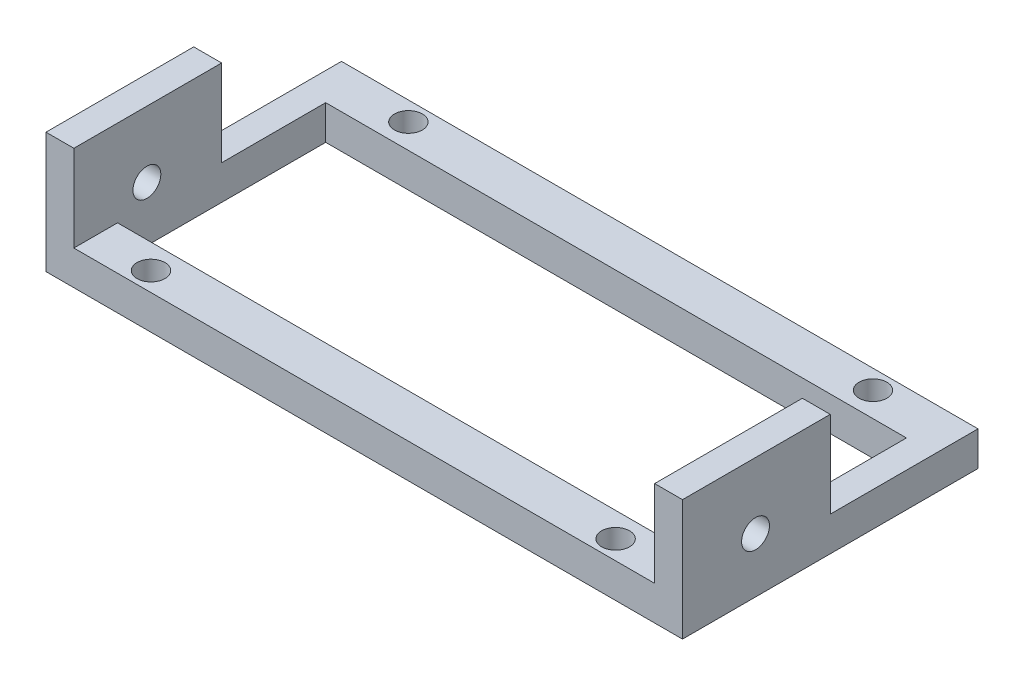
ISO-10303-21;
HEADER;
FILE_DESCRIPTION(('STEP AP214'),'2;1');
FILE_NAME('part.step','',(''),(''),'','','');
FILE_SCHEMA(('AUTOMOTIVE_DESIGN { 1 0 10303 214 1 1 1 1 }'));
ENDSEC;
DATA;
#1=APPLICATION_CONTEXT('core data for automotive mechanical design processes');
#2=APPLICATION_PROTOCOL_DEFINITION('international standard','automotive_design',2000,#1);
#3=PRODUCT_CONTEXT('',#1,'mechanical');
#4=PRODUCT('Part','Part','',(#3));
#5=PRODUCT_RELATED_PRODUCT_CATEGORY('part','',(#4));
#6=PRODUCT_DEFINITION_FORMATION('','',#4);
#7=PRODUCT_DEFINITION_CONTEXT('part definition',#1,'design');
#8=PRODUCT_DEFINITION('design','',#6,#7);
#9=PRODUCT_DEFINITION_SHAPE('','',#8);
#10=(LENGTH_UNIT() NAMED_UNIT(*) SI_UNIT(.MILLI.,.METRE.));
#11=(NAMED_UNIT(*) PLANE_ANGLE_UNIT() SI_UNIT($,.RADIAN.));
#12=(NAMED_UNIT(*) SI_UNIT($,.STERADIAN.) SOLID_ANGLE_UNIT());
#13=UNCERTAINTY_MEASURE_WITH_UNIT(LENGTH_MEASURE(1.E-05),#10,'distance_accuracy_value','');
#14=(GEOMETRIC_REPRESENTATION_CONTEXT(3) GLOBAL_UNCERTAINTY_ASSIGNED_CONTEXT((#13)) GLOBAL_UNIT_ASSIGNED_CONTEXT((#10,
#11,#12)) REPRESENTATION_CONTEXT('',''));
#15=CARTESIAN_POINT('',(0.,0.,0.));
#16=DIRECTION('',(0.,0.,1.));
#17=DIRECTION('',(1.,0.,0.));
#18=AXIS2_PLACEMENT_3D('',#15,#16,#17);
#19=CARTESIAN_POINT('',(0.,3.7,0.));
#20=DIRECTION('',(0.,1.,0.));
#21=DIRECTION('',(0.,0.,1.));
#22=AXIS2_PLACEMENT_3D('',#19,#20,#21);
#23=PLANE('',#22);
#24=CARTESIAN_POINT('',(-25.,3.7,-0.3));
#25=DIRECTION('',(0.,1.,0.));
#26=DIRECTION('',(0.,0.,1.));
#27=AXIS2_PLACEMENT_3D('',#24,#25,#26);
#28=CIRCLE('',#27,1.5);
#29=CARTESIAN_POINT('',(-25.,3.7,1.2));
#30=VERTEX_POINT('',#29);
#31=EDGE_CURVE('E271',#30,#30,#28,.T.);
#32=ORIENTED_EDGE('',*,*,#31,.F.);
#33=EDGE_LOOP('',(#32));
#34=FACE_BOUND('',#33,.T.);
#35=CARTESIAN_POINT('',(25.,3.7,-0.3));
#36=DIRECTION('',(0.,1.,0.));
#37=DIRECTION('',(0.,0.,1.));
#38=AXIS2_PLACEMENT_3D('',#35,#36,#37);
#39=CIRCLE('',#38,1.5);
#40=CARTESIAN_POINT('',(25.,3.7,1.2));
#41=VERTEX_POINT('',#40);
#42=EDGE_CURVE('E265',#41,#41,#39,.T.);
#43=ORIENTED_EDGE('',*,*,#42,.F.);
#44=EDGE_LOOP('',(#43));
#45=FACE_BOUND('',#44,.T.);
#46=DIRECTION('',(0.,0.,-1.));
#47=VECTOR('',#46,1.);
#48=CARTESIAN_POINT('',(31.25,3.7,-2.35));
#49=LINE('',#48,#47);
#50=CARTESIAN_POINT('',(31.25,3.7,13.55));
#51=VERTEX_POINT('',#50);
#52=CARTESIAN_POINT('',(31.25,3.7,2.35));
#53=VERTEX_POINT('',#52);
#54=EDGE_CURVE('E61',#51,#53,#49,.T.);
#55=ORIENTED_EDGE('',*,*,#54,.F.);
#56=DIRECTION('',(1.,0.,0.));
#57=VECTOR('',#56,1.);
#58=CARTESIAN_POINT('',(0.,3.7,13.55));
#59=LINE('',#58,#57);
#60=CARTESIAN_POINT('',(34.25,3.7,13.55));
#61=VERTEX_POINT('',#60);
#62=EDGE_CURVE('E185',#51,#61,#59,.T.);
#63=ORIENTED_EDGE('',*,*,#62,.T.);
#64=DIRECTION('',(0.,0.,-1.));
#65=VECTOR('',#64,1.);
#66=CARTESIAN_POINT('',(34.25,3.7,-2.35));
#67=LINE('',#66,#65);
#68=CARTESIAN_POINT('',(34.25,3.7,-2.35));
#69=VERTEX_POINT('',#68);
#70=EDGE_CURVE('E152',#61,#69,#67,.T.);
#71=ORIENTED_EDGE('',*,*,#70,.T.);
#72=DIRECTION('',(-1.,0.,0.));
#73=VECTOR('',#72,1.);
#74=CARTESIAN_POINT('',(-31.25,3.7,-2.35));
#75=LINE('',#74,#73);
#76=CARTESIAN_POINT('',(-34.25,3.7,-2.35));
#77=VERTEX_POINT('',#76);
#78=EDGE_CURVE('E277',#69,#77,#75,.T.);
#79=ORIENTED_EDGE('',*,*,#78,.T.);
#80=DIRECTION('',(0.,0.,-1.));
#81=VECTOR('',#80,1.);
#82=CARTESIAN_POINT('',(-34.25,3.7,-2.35));
#83=LINE('',#82,#81);
#84=CARTESIAN_POINT('',(-34.25,3.7,13.55));
#85=VERTEX_POINT('',#84);
#86=EDGE_CURVE('E258',#85,#77,#83,.T.);
#87=ORIENTED_EDGE('',*,*,#86,.F.);
#88=DIRECTION('',(-1.,0.,0.));
#89=VECTOR('',#88,1.);
#90=CARTESIAN_POINT('',(0.,3.7,13.55));
#91=LINE('',#90,#89);
#92=CARTESIAN_POINT('',(-31.25,3.7,13.55));
#93=VERTEX_POINT('',#92);
#94=EDGE_CURVE('E214',#93,#85,#91,.T.);
#95=ORIENTED_EDGE('',*,*,#94,.F.);
#96=DIRECTION('',(0.,0.,-1.));
#97=VECTOR('',#96,1.);
#98=CARTESIAN_POINT('',(-31.25,3.7,-2.35));
#99=LINE('',#98,#97);
#100=CARTESIAN_POINT('',(-31.25,3.7,2.35));
#101=VERTEX_POINT('',#100);
#102=EDGE_CURVE('E254',#93,#101,#99,.T.);
#103=ORIENTED_EDGE('',*,*,#102,.T.);
#104=DIRECTION('',(1.,0.,0.));
#105=VECTOR('',#104,1.);
#106=CARTESIAN_POINT('',(-31.25,3.7,2.35));
#107=LINE('',#106,#105);
#108=EDGE_CURVE('E280',#101,#53,#107,.T.);
#109=ORIENTED_EDGE('',*,*,#108,.T.);
#110=EDGE_LOOP('',(#55,#63,#71,#79,#87,#95,#103,#109));
#111=FACE_BOUND('',#110,.T.);
#112=ADVANCED_FACE('F37',(#34,#45,#111),#23,.T.);
#113=CARTESIAN_POINT('',(-25.,3.7,27.4));
#114=DIRECTION('',(0.,-1.,0.));
#115=DIRECTION('',(0.,0.,-1.));
#116=AXIS2_PLACEMENT_3D('',#113,#114,#115);
#117=CIRCLE('',#116,1.5);
#118=CARTESIAN_POINT('',(-25.,3.7,25.9));
#119=VERTEX_POINT('',#118);
#120=EDGE_CURVE('E224',#119,#119,#117,.T.);
#121=ORIENTED_EDGE('',*,*,#120,.T.);
#122=EDGE_LOOP('',(#121));
#123=FACE_BOUND('',#122,.T.);
#124=CARTESIAN_POINT('',(25.,3.7,27.4));
#125=DIRECTION('',(0.,-1.,0.));
#126=DIRECTION('',(0.,0.,-1.));
#127=AXIS2_PLACEMENT_3D('',#124,#125,#126);
#128=CIRCLE('',#127,1.5);
#129=CARTESIAN_POINT('',(25.,3.7,25.9));
#130=VERTEX_POINT('',#129);
#131=EDGE_CURVE('E218',#130,#130,#128,.T.);
#132=ORIENTED_EDGE('',*,*,#131,.T.);
#133=EDGE_LOOP('',(#132));
#134=FACE_BOUND('',#133,.T.);
#135=DIRECTION('',(1.,0.,0.));
#136=VECTOR('',#135,1.);
#137=CARTESIAN_POINT('',(-34.25,3.7,29.45));
#138=LINE('',#137,#136);
#139=CARTESIAN_POINT('',(-31.25,3.7,29.45));
#140=VERTEX_POINT('',#139);
#141=CARTESIAN_POINT('',(31.25,3.7,29.45));
#142=VERTEX_POINT('',#141);
#143=EDGE_CURVE('E53',#140,#142,#138,.T.);
#144=ORIENTED_EDGE('',*,*,#143,.T.);
#145=DIRECTION('',(0.,0.,-1.));
#146=VECTOR('',#145,1.);
#147=CARTESIAN_POINT('',(31.25,3.7,0.));
#148=LINE('',#147,#146);
#149=CARTESIAN_POINT('',(31.25,3.7,24.75));
#150=VERTEX_POINT('',#149);
#151=EDGE_CURVE('E179',#142,#150,#148,.T.);
#152=ORIENTED_EDGE('',*,*,#151,.T.);
#153=DIRECTION('',(1.,0.,0.));
#154=VECTOR('',#153,1.);
#155=CARTESIAN_POINT('',(-31.25,3.7,24.75));
#156=LINE('',#155,#154);
#157=CARTESIAN_POINT('',(-31.25,3.7,24.75));
#158=VERTEX_POINT('',#157);
#159=EDGE_CURVE('E230',#158,#150,#156,.T.);
#160=ORIENTED_EDGE('',*,*,#159,.F.);
#161=DIRECTION('',(0.,0.,-1.));
#162=VECTOR('',#161,1.);
#163=CARTESIAN_POINT('',(-31.25,3.7,0.));
#164=LINE('',#163,#162);
#165=EDGE_CURVE('E206',#140,#158,#164,.T.);
#166=ORIENTED_EDGE('',*,*,#165,.F.);
#167=EDGE_LOOP('',(#144,#152,#160,#166));
#168=FACE_BOUND('',#167,.T.);
#169=ADVANCED_FACE('F305',(#123,#134,#168),#23,.T.);
#170=CARTESIAN_POINT('',(0.,0.,0.));
#171=DIRECTION('',(0.,1.,0.));
#172=DIRECTION('',(0.,0.,1.));
#173=AXIS2_PLACEMENT_3D('',#170,#171,#172);
#174=PLANE('',#173);
#175=DIRECTION('',(0.,0.,1.));
#176=VECTOR('',#175,1.);
#177=CARTESIAN_POINT('',(34.25,0.,-2.35));
#178=LINE('',#177,#176);
#179=CARTESIAN_POINT('',(34.25,0.,-2.35));
#180=VERTEX_POINT('',#179);
#181=CARTESIAN_POINT('',(34.25,0.,29.45));
#182=VERTEX_POINT('',#181);
#183=EDGE_CURVE('E151',#180,#182,#178,.T.);
#184=ORIENTED_EDGE('',*,*,#183,.T.);
#185=DIRECTION('',(1.,0.,0.));
#186=VECTOR('',#185,1.);
#187=CARTESIAN_POINT('',(-34.25,0.,29.45));
#188=LINE('',#187,#186);
#189=CARTESIAN_POINT('',(-34.25,0.,29.45));
#190=VERTEX_POINT('',#189);
#191=EDGE_CURVE('E146',#190,#182,#188,.T.);
#192=ORIENTED_EDGE('',*,*,#191,.F.);
#193=DIRECTION('',(0.,0.,1.));
#194=VECTOR('',#193,1.);
#195=CARTESIAN_POINT('',(-34.25,0.,-2.35));
#196=LINE('',#195,#194);
#197=CARTESIAN_POINT('',(-34.25,0.,-2.35));
#198=VERTEX_POINT('',#197);
#199=EDGE_CURVE('E253',#198,#190,#196,.T.);
#200=ORIENTED_EDGE('',*,*,#199,.F.);
#201=DIRECTION('',(-1.,0.,0.));
#202=VECTOR('',#201,1.);
#203=CARTESIAN_POINT('',(-31.25,0.,-2.35));
#204=LINE('',#203,#202);
#205=EDGE_CURVE('E274',#180,#198,#204,.T.);
#206=ORIENTED_EDGE('',*,*,#205,.F.);
#207=EDGE_LOOP('',(#184,#192,#200,#206));
#208=FACE_BOUND('',#207,.T.);
#209=DIRECTION('',(1.,0.,0.));
#210=VECTOR('',#209,1.);
#211=CARTESIAN_POINT('',(-31.25,0.,24.75));
#212=LINE('',#211,#210);
#213=CARTESIAN_POINT('',(-31.25,0.,24.75));
#214=VERTEX_POINT('',#213);
#215=CARTESIAN_POINT('',(31.25,0.,24.75));
#216=VERTEX_POINT('',#215);
#217=EDGE_CURVE('E227',#214,#216,#212,.T.);
#218=ORIENTED_EDGE('',*,*,#217,.T.);
#219=DIRECTION('',(0.,0.,1.));
#220=VECTOR('',#219,1.);
#221=CARTESIAN_POINT('',(31.25,0.,-2.35));
#222=LINE('',#221,#220);
#223=CARTESIAN_POINT('',(31.25,0.,2.35));
#224=VERTEX_POINT('',#223);
#225=EDGE_CURVE('E244',#224,#216,#222,.T.);
#226=ORIENTED_EDGE('',*,*,#225,.F.);
#227=DIRECTION('',(1.,0.,0.));
#228=VECTOR('',#227,1.);
#229=CARTESIAN_POINT('',(-31.25,0.,2.35));
#230=LINE('',#229,#228);
#231=CARTESIAN_POINT('',(-31.25,0.,2.35));
#232=VERTEX_POINT('',#231);
#233=EDGE_CURVE('E281',#232,#224,#230,.T.);
#234=ORIENTED_EDGE('',*,*,#233,.F.);
#235=DIRECTION('',(0.,0.,1.));
#236=VECTOR('',#235,1.);
#237=CARTESIAN_POINT('',(-31.25,0.,-2.35));
#238=LINE('',#237,#236);
#239=EDGE_CURVE('E247',#232,#214,#238,.T.);
#240=ORIENTED_EDGE('',*,*,#239,.T.);
#241=EDGE_LOOP('',(#218,#226,#234,#240));
#242=FACE_BOUND('',#241,.T.);
#243=CARTESIAN_POINT('',(-25.,0.,27.4));
#244=DIRECTION('',(0.,-1.,0.));
#245=DIRECTION('',(0.,0.,-1.));
#246=AXIS2_PLACEMENT_3D('',#243,#244,#245);
#247=CIRCLE('',#246,1.5);
#248=CARTESIAN_POINT('',(-25.,0.,25.9));
#249=VERTEX_POINT('',#248);
#250=EDGE_CURVE('E221',#249,#249,#247,.T.);
#251=ORIENTED_EDGE('',*,*,#250,.F.);
#252=EDGE_LOOP('',(#251));
#253=FACE_BOUND('',#252,.T.);
#254=CARTESIAN_POINT('',(25.,0.,27.4));
#255=DIRECTION('',(0.,-1.,0.));
#256=DIRECTION('',(0.,0.,-1.));
#257=AXIS2_PLACEMENT_3D('',#254,#255,#256);
#258=CIRCLE('',#257,1.5);
#259=CARTESIAN_POINT('',(25.,0.,25.9));
#260=VERTEX_POINT('',#259);
#261=EDGE_CURVE('E217',#260,#260,#258,.T.);
#262=ORIENTED_EDGE('',*,*,#261,.F.);
#263=EDGE_LOOP('',(#262));
#264=FACE_BOUND('',#263,.T.);
#265=CARTESIAN_POINT('',(25.,0.,-0.3));
#266=DIRECTION('',(0.,1.,0.));
#267=DIRECTION('',(0.,0.,1.));
#268=AXIS2_PLACEMENT_3D('',#265,#266,#267);
#269=CIRCLE('',#268,1.5);
#270=CARTESIAN_POINT('',(25.,0.,1.2));
#271=VERTEX_POINT('',#270);
#272=EDGE_CURVE('E264',#271,#271,#269,.T.);
#273=ORIENTED_EDGE('',*,*,#272,.T.);
#274=EDGE_LOOP('',(#273));
#275=FACE_BOUND('',#274,.T.);
#276=CARTESIAN_POINT('',(-25.,0.,-0.3));
#277=DIRECTION('',(0.,1.,0.));
#278=DIRECTION('',(0.,0.,1.));
#279=AXIS2_PLACEMENT_3D('',#276,#277,#278);
#280=CIRCLE('',#279,1.5);
#281=CARTESIAN_POINT('',(-25.,0.,1.2));
#282=VERTEX_POINT('',#281);
#283=EDGE_CURVE('E268',#282,#282,#280,.T.);
#284=ORIENTED_EDGE('',*,*,#283,.T.);
#285=EDGE_LOOP('',(#284));
#286=FACE_BOUND('',#285,.T.);
#287=ADVANCED_FACE('F295',(#208,#242,#253,#264,#275,#286),#174,.F.);
#288=CARTESIAN_POINT('',(-31.25,3.7,-2.35));
#289=DIRECTION('',(0.,0.,1.));
#290=DIRECTION('',(1.,0.,0.));
#291=AXIS2_PLACEMENT_3D('',#288,#289,#290);
#292=PLANE('',#291);
#293=ORIENTED_EDGE('',*,*,#205,.T.);
#294=DIRECTION('',(0.,-1.,0.));
#295=VECTOR('',#294,1.);
#296=CARTESIAN_POINT('',(-34.25,3.7,-2.35));
#297=LINE('',#296,#295);
#298=EDGE_CURVE('E250',#77,#198,#297,.T.);
#299=ORIENTED_EDGE('',*,*,#298,.F.);
#300=ORIENTED_EDGE('',*,*,#78,.F.);
#301=DIRECTION('',(0.,-1.,0.));
#302=VECTOR('',#301,1.);
#303=CARTESIAN_POINT('',(34.25,3.7,-2.35));
#304=LINE('',#303,#302);
#305=EDGE_CURVE('E241',#69,#180,#304,.T.);
#306=ORIENTED_EDGE('',*,*,#305,.T.);
#307=EDGE_LOOP('',(#293,#299,#300,#306));
#308=FACE_BOUND('',#307,.T.);
#309=ADVANCED_FACE('F39',(#308),#292,.F.);
#310=CARTESIAN_POINT('',(-31.25,3.7,2.35));
#311=DIRECTION('',(0.,0.,-1.));
#312=DIRECTION('',(-1.,0.,0.));
#313=AXIS2_PLACEMENT_3D('',#310,#311,#312);
#314=PLANE('',#313);
#315=ORIENTED_EDGE('',*,*,#233,.T.);
#316=DIRECTION('',(0.,-1.,0.));
#317=VECTOR('',#316,1.);
#318=CARTESIAN_POINT('',(31.25,3.7,2.35));
#319=LINE('',#318,#317);
#320=EDGE_CURVE('E46',#53,#224,#319,.T.);
#321=ORIENTED_EDGE('',*,*,#320,.F.);
#322=ORIENTED_EDGE('',*,*,#108,.F.);
#323=DIRECTION('',(0.,-1.,0.));
#324=VECTOR('',#323,1.);
#325=CARTESIAN_POINT('',(-31.25,3.7,2.35));
#326=LINE('',#325,#324);
#327=EDGE_CURVE('E11',#101,#232,#326,.T.);
#328=ORIENTED_EDGE('',*,*,#327,.T.);
#329=EDGE_LOOP('',(#315,#321,#322,#328));
#330=FACE_BOUND('',#329,.T.);
#331=ADVANCED_FACE('F324',(#330),#314,.F.);
#332=CARTESIAN_POINT('',(-25.,3.7,-0.3));
#333=DIRECTION('',(0.,-1.,0.));
#334=DIRECTION('',(0.,0.,-1.));
#335=AXIS2_PLACEMENT_3D('',#332,#333,#334);
#336=CYLINDRICAL_SURFACE('',#335,1.5);
#337=ORIENTED_EDGE('',*,*,#31,.T.);
#338=EDGE_LOOP('',(#337));
#339=FACE_BOUND('',#338,.T.);
#340=ORIENTED_EDGE('',*,*,#283,.F.);
#341=EDGE_LOOP('',(#340));
#342=FACE_BOUND('',#341,.T.);
#343=ADVANCED_FACE('F326',(#339,#342),#336,.F.);
#344=CARTESIAN_POINT('',(25.,3.7,-0.3));
#345=DIRECTION('',(0.,-1.,0.));
#346=DIRECTION('',(0.,0.,-1.));
#347=AXIS2_PLACEMENT_3D('',#344,#345,#346);
#348=CYLINDRICAL_SURFACE('',#347,1.5);
#349=ORIENTED_EDGE('',*,*,#42,.T.);
#350=EDGE_LOOP('',(#349));
#351=FACE_BOUND('',#350,.T.);
#352=ORIENTED_EDGE('',*,*,#272,.F.);
#353=EDGE_LOOP('',(#352));
#354=FACE_BOUND('',#353,.T.);
#355=ADVANCED_FACE('F331',(#351,#354),#348,.F.);
#356=CARTESIAN_POINT('',(-34.25,3.7,29.45));
#357=DIRECTION('',(0.,0.,-1.));
#358=DIRECTION('',(0.,1.,0.));
#359=AXIS2_PLACEMENT_3D('',#356,#357,#358);
#360=PLANE('',#359);
#361=DIRECTION('',(0.,1.,0.));
#362=VECTOR('',#361,1.);
#363=CARTESIAN_POINT('',(34.25,3.7,29.45));
#364=LINE('',#363,#362);
#365=CARTESIAN_POINT('',(34.25,13.,29.45));
#366=VERTEX_POINT('',#365);
#367=EDGE_CURVE('E139',#182,#366,#364,.T.);
#368=ORIENTED_EDGE('',*,*,#367,.T.);
#369=DIRECTION('',(1.,0.,0.));
#370=VECTOR('',#369,1.);
#371=CARTESIAN_POINT('',(34.25,13.,29.45));
#372=LINE('',#371,#370);
#373=CARTESIAN_POINT('',(31.25,13.,29.45));
#374=VERTEX_POINT('',#373);
#375=EDGE_CURVE('E143',#374,#366,#372,.T.);
#376=ORIENTED_EDGE('',*,*,#375,.F.);
#377=DIRECTION('',(0.,-1.,0.));
#378=VECTOR('',#377,1.);
#379=CARTESIAN_POINT('',(31.25,13.,29.45));
#380=LINE('',#379,#378);
#381=EDGE_CURVE('E177',#374,#142,#380,.T.);
#382=ORIENTED_EDGE('',*,*,#381,.T.);
#383=ORIENTED_EDGE('',*,*,#143,.F.);
#384=DIRECTION('',(0.,-1.,0.));
#385=VECTOR('',#384,1.);
#386=CARTESIAN_POINT('',(-31.25,13.,29.45));
#387=LINE('',#386,#385);
#388=CARTESIAN_POINT('',(-31.25,13.,29.45));
#389=VERTEX_POINT('',#388);
#390=EDGE_CURVE('E203',#389,#140,#387,.T.);
#391=ORIENTED_EDGE('',*,*,#390,.F.);
#392=DIRECTION('',(-1.,0.,0.));
#393=VECTOR('',#392,1.);
#394=CARTESIAN_POINT('',(-34.25,13.,29.45));
#395=LINE('',#394,#393);
#396=CARTESIAN_POINT('',(-34.25,13.,29.45));
#397=VERTEX_POINT('',#396);
#398=EDGE_CURVE('E199',#389,#397,#395,.T.);
#399=ORIENTED_EDGE('',*,*,#398,.T.);
#400=DIRECTION('',(0.,1.,0.));
#401=VECTOR('',#400,1.);
#402=CARTESIAN_POINT('',(-34.25,3.7,29.45));
#403=LINE('',#402,#401);
#404=EDGE_CURVE('E256',#190,#397,#403,.T.);
#405=ORIENTED_EDGE('',*,*,#404,.F.);
#406=ORIENTED_EDGE('',*,*,#191,.T.);
#407=EDGE_LOOP('',(#368,#376,#382,#383,#391,#399,#405,#406));
#408=FACE_BOUND('',#407,.T.);
#409=ADVANCED_FACE('F141',(#408),#360,.F.);
#410=CARTESIAN_POINT('',(-34.25,0.,0.));
#411=DIRECTION('',(-1.,0.,0.));
#412=DIRECTION('',(0.,0.,1.));
#413=AXIS2_PLACEMENT_3D('',#410,#411,#412);
#414=PLANE('',#413);
#415=CARTESIAN_POINT('',(-34.25,5.9,21.5927431767042));
#416=DIRECTION('',(-1.,0.,0.));
#417=DIRECTION('',(0.,0.,1.));
#418=AXIS2_PLACEMENT_3D('',#415,#416,#417);
#419=CIRCLE('',#418,1.5);
#420=CARTESIAN_POINT('',(-34.25,5.9,23.0927431767042));
#421=VERTEX_POINT('',#420);
#422=EDGE_CURVE('E187',#421,#421,#419,.T.);
#423=ORIENTED_EDGE('',*,*,#422,.F.);
#424=EDGE_LOOP('',(#423));
#425=FACE_BOUND('',#424,.T.);
#426=ORIENTED_EDGE('',*,*,#199,.T.);
#427=ORIENTED_EDGE('',*,*,#404,.T.);
#428=DIRECTION('',(0.,0.,-1.));
#429=VECTOR('',#428,1.);
#430=CARTESIAN_POINT('',(-34.25,13.,29.45));
#431=LINE('',#430,#429);
#432=CARTESIAN_POINT('',(-34.25,13.,13.55));
#433=VERTEX_POINT('',#432);
#434=EDGE_CURVE('E190',#397,#433,#431,.T.);
#435=ORIENTED_EDGE('',*,*,#434,.T.);
#436=DIRECTION('',(0.,-1.,0.));
#437=VECTOR('',#436,1.);
#438=CARTESIAN_POINT('',(-34.25,13.,13.55));
#439=LINE('',#438,#437);
#440=EDGE_CURVE('E202',#433,#85,#439,.T.);
#441=ORIENTED_EDGE('',*,*,#440,.T.);
#442=ORIENTED_EDGE('',*,*,#86,.T.);
#443=ORIENTED_EDGE('',*,*,#298,.T.);
#444=EDGE_LOOP('',(#426,#427,#435,#441,#442,#443));
#445=FACE_BOUND('',#444,.T.);
#446=ADVANCED_FACE('F318',(#425,#445),#414,.T.);
#447=CARTESIAN_POINT('',(-31.25,0.,0.));
#448=DIRECTION('',(-1.,0.,0.));
#449=DIRECTION('',(0.,0.,1.));
#450=AXIS2_PLACEMENT_3D('',#447,#448,#449);
#451=PLANE('',#450);
#452=CARTESIAN_POINT('',(-31.25,5.9,21.5927431767042));
#453=DIRECTION('',(-1.,0.,0.));
#454=DIRECTION('',(0.,0.,1.));
#455=AXIS2_PLACEMENT_3D('',#452,#453,#454);
#456=CIRCLE('',#455,1.5);
#457=CARTESIAN_POINT('',(-31.25,5.9,23.0927431767042));
#458=VERTEX_POINT('',#457);
#459=EDGE_CURVE('E41',#458,#458,#456,.T.);
#460=ORIENTED_EDGE('',*,*,#459,.T.);
#461=EDGE_LOOP('',(#460));
#462=FACE_BOUND('',#461,.T.);
#463=ORIENTED_EDGE('',*,*,#102,.F.);
#464=DIRECTION('',(0.,-1.,0.));
#465=VECTOR('',#464,1.);
#466=CARTESIAN_POINT('',(-31.25,13.,13.55));
#467=LINE('',#466,#465);
#468=CARTESIAN_POINT('',(-31.25,13.,13.55));
#469=VERTEX_POINT('',#468);
#470=EDGE_CURVE('E207',#469,#93,#467,.T.);
#471=ORIENTED_EDGE('',*,*,#470,.F.);
#472=DIRECTION('',(0.,0.,1.));
#473=VECTOR('',#472,1.);
#474=CARTESIAN_POINT('',(-31.25,13.,29.45));
#475=LINE('',#474,#473);
#476=EDGE_CURVE('E196',#469,#389,#475,.T.);
#477=ORIENTED_EDGE('',*,*,#476,.T.);
#478=ORIENTED_EDGE('',*,*,#390,.T.);
#479=ORIENTED_EDGE('',*,*,#165,.T.);
#480=DIRECTION('',(0.,-1.,0.));
#481=VECTOR('',#480,1.);
#482=CARTESIAN_POINT('',(-31.25,3.7,24.75));
#483=LINE('',#482,#481);
#484=EDGE_CURVE('E233',#158,#214,#483,.T.);
#485=ORIENTED_EDGE('',*,*,#484,.T.);
#486=ORIENTED_EDGE('',*,*,#239,.F.);
#487=ORIENTED_EDGE('',*,*,#327,.F.);
#488=EDGE_LOOP('',(#463,#471,#477,#478,#479,#485,#486,#487));
#489=FACE_BOUND('',#488,.T.);
#490=ADVANCED_FACE('F303',(#462,#489),#451,.F.);
#491=CARTESIAN_POINT('',(31.25,0.,0.));
#492=DIRECTION('',(1.,0.,0.));
#493=DIRECTION('',(0.,0.,1.));
#494=AXIS2_PLACEMENT_3D('',#491,#492,#493);
#495=PLANE('',#494);
#496=CARTESIAN_POINT('',(31.25,5.9,21.5927431767042));
#497=DIRECTION('',(1.,0.,0.));
#498=DIRECTION('',(0.,0.,-1.));
#499=AXIS2_PLACEMENT_3D('',#496,#497,#498);
#500=CIRCLE('',#499,1.5);
#501=CARTESIAN_POINT('',(31.25,5.9,20.0927431767042));
#502=VERTEX_POINT('',#501);
#503=EDGE_CURVE('E167',#502,#502,#500,.F.);
#504=ORIENTED_EDGE('',*,*,#503,.F.);
#505=EDGE_LOOP('',(#504));
#506=FACE_BOUND('',#505,.T.);
#507=DIRECTION('',(0.,-1.,0.));
#508=VECTOR('',#507,1.);
#509=CARTESIAN_POINT('',(31.25,3.7,24.75));
#510=LINE('',#509,#508);
#511=EDGE_CURVE('E238',#150,#216,#510,.T.);
#512=ORIENTED_EDGE('',*,*,#511,.F.);
#513=ORIENTED_EDGE('',*,*,#151,.F.);
#514=ORIENTED_EDGE('',*,*,#381,.F.);
#515=DIRECTION('',(0.,0.,1.));
#516=VECTOR('',#515,1.);
#517=CARTESIAN_POINT('',(31.25,13.,29.45));
#518=LINE('',#517,#516);
#519=CARTESIAN_POINT('',(31.25,13.,13.55));
#520=VERTEX_POINT('',#519);
#521=EDGE_CURVE('E160',#520,#374,#518,.T.);
#522=ORIENTED_EDGE('',*,*,#521,.F.);
#523=DIRECTION('',(0.,-1.,0.));
#524=VECTOR('',#523,1.);
#525=CARTESIAN_POINT('',(31.25,13.,13.55));
#526=LINE('',#525,#524);
#527=EDGE_CURVE('E180',#520,#51,#526,.T.);
#528=ORIENTED_EDGE('',*,*,#527,.T.);
#529=ORIENTED_EDGE('',*,*,#54,.T.);
#530=ORIENTED_EDGE('',*,*,#320,.T.);
#531=ORIENTED_EDGE('',*,*,#225,.T.);
#532=EDGE_LOOP('',(#512,#513,#514,#522,#528,#529,#530,#531));
#533=FACE_BOUND('',#532,.T.);
#534=ADVANCED_FACE('F290',(#506,#533),#495,.F.);
#535=CARTESIAN_POINT('',(34.25,0.,0.));
#536=DIRECTION('',(1.,0.,0.));
#537=DIRECTION('',(0.,0.,1.));
#538=AXIS2_PLACEMENT_3D('',#535,#536,#537);
#539=PLANE('',#538);
#540=CARTESIAN_POINT('',(34.25,5.9,21.5927431767042));
#541=DIRECTION('',(-1.,0.,0.));
#542=DIRECTION('',(0.,0.,1.));
#543=AXIS2_PLACEMENT_3D('',#540,#541,#542);
#544=CIRCLE('',#543,1.5);
#545=CARTESIAN_POINT('',(34.25,5.9,23.0927431767042));
#546=VERTEX_POINT('',#545);
#547=EDGE_CURVE('E170',#546,#546,#544,.T.);
#548=ORIENTED_EDGE('',*,*,#547,.T.);
#549=EDGE_LOOP('',(#548));
#550=FACE_BOUND('',#549,.T.);
#551=ORIENTED_EDGE('',*,*,#367,.F.);
#552=ORIENTED_EDGE('',*,*,#183,.F.);
#553=ORIENTED_EDGE('',*,*,#305,.F.);
#554=ORIENTED_EDGE('',*,*,#70,.F.);
#555=DIRECTION('',(0.,-1.,0.));
#556=VECTOR('',#555,1.);
#557=CARTESIAN_POINT('',(34.25,13.,13.55));
#558=LINE('',#557,#556);
#559=CARTESIAN_POINT('',(34.25,13.,13.55));
#560=VERTEX_POINT('',#559);
#561=EDGE_CURVE('E166',#560,#61,#558,.T.);
#562=ORIENTED_EDGE('',*,*,#561,.F.);
#563=DIRECTION('',(0.,0.,-1.));
#564=VECTOR('',#563,1.);
#565=CARTESIAN_POINT('',(34.25,13.,29.45));
#566=LINE('',#565,#564);
#567=EDGE_CURVE('E157',#366,#560,#566,.T.);
#568=ORIENTED_EDGE('',*,*,#567,.F.);
#569=EDGE_LOOP('',(#551,#552,#553,#554,#562,#568));
#570=FACE_BOUND('',#569,.T.);
#571=ADVANCED_FACE('F163',(#550,#570),#539,.T.);
#572=CARTESIAN_POINT('',(-31.25,3.7,24.75));
#573=DIRECTION('',(0.,0.,-1.));
#574=DIRECTION('',(-1.,0.,0.));
#575=AXIS2_PLACEMENT_3D('',#572,#573,#574);
#576=PLANE('',#575);
#577=ORIENTED_EDGE('',*,*,#217,.F.);
#578=ORIENTED_EDGE('',*,*,#484,.F.);
#579=ORIENTED_EDGE('',*,*,#159,.T.);
#580=ORIENTED_EDGE('',*,*,#511,.T.);
#581=EDGE_LOOP('',(#577,#578,#579,#580));
#582=FACE_BOUND('',#581,.T.);
#583=ADVANCED_FACE('F299',(#582),#576,.T.);
#584=CARTESIAN_POINT('',(-25.,3.7,27.4));
#585=DIRECTION('',(0.,-1.,0.));
#586=DIRECTION('',(0.,0.,-1.));
#587=AXIS2_PLACEMENT_3D('',#584,#585,#586);
#588=CYLINDRICAL_SURFACE('',#587,1.5);
#589=ORIENTED_EDGE('',*,*,#120,.F.);
#590=EDGE_LOOP('',(#589));
#591=FACE_BOUND('',#590,.T.);
#592=ORIENTED_EDGE('',*,*,#250,.T.);
#593=EDGE_LOOP('',(#592));
#594=FACE_BOUND('',#593,.T.);
#595=ADVANCED_FACE('F375',(#591,#594),#588,.F.);
#596=CARTESIAN_POINT('',(25.,3.7,27.4));
#597=DIRECTION('',(0.,-1.,0.));
#598=DIRECTION('',(0.,0.,-1.));
#599=AXIS2_PLACEMENT_3D('',#596,#597,#598);
#600=CYLINDRICAL_SURFACE('',#599,1.5);
#601=ORIENTED_EDGE('',*,*,#131,.F.);
#602=EDGE_LOOP('',(#601));
#603=FACE_BOUND('',#602,.T.);
#604=ORIENTED_EDGE('',*,*,#261,.T.);
#605=EDGE_LOOP('',(#604));
#606=FACE_BOUND('',#605,.T.);
#607=ADVANCED_FACE('F380',(#603,#606),#600,.F.);
#608=CARTESIAN_POINT('',(-34.25,13.,13.55));
#609=DIRECTION('',(0.,0.,-1.));
#610=DIRECTION('',(-1.,0.,0.));
#611=AXIS2_PLACEMENT_3D('',#608,#609,#610);
#612=PLANE('',#611);
#613=ORIENTED_EDGE('',*,*,#470,.T.);
#614=ORIENTED_EDGE('',*,*,#94,.T.);
#615=ORIENTED_EDGE('',*,*,#440,.F.);
#616=DIRECTION('',(1.,0.,0.));
#617=VECTOR('',#616,1.);
#618=CARTESIAN_POINT('',(-34.25,13.,13.55));
#619=LINE('',#618,#617);
#620=EDGE_CURVE('E193',#433,#469,#619,.T.);
#621=ORIENTED_EDGE('',*,*,#620,.T.);
#622=EDGE_LOOP('',(#613,#614,#615,#621));
#623=FACE_BOUND('',#622,.T.);
#624=ADVANCED_FACE('F316',(#623),#612,.T.);
#625=CARTESIAN_POINT('',(0.,13.,0.));
#626=DIRECTION('',(0.,-1.,0.));
#627=DIRECTION('',(0.,0.,-1.));
#628=AXIS2_PLACEMENT_3D('',#625,#626,#627);
#629=PLANE('',#628);
#630=ORIENTED_EDGE('',*,*,#434,.F.);
#631=ORIENTED_EDGE('',*,*,#398,.F.);
#632=ORIENTED_EDGE('',*,*,#476,.F.);
#633=ORIENTED_EDGE('',*,*,#620,.F.);
#634=EDGE_LOOP('',(#630,#631,#632,#633));
#635=FACE_BOUND('',#634,.T.);
#636=ADVANCED_FACE('F322',(#635),#629,.F.);
#637=CARTESIAN_POINT('',(-21.25,5.9,21.5927431767042));
#638=DIRECTION('',(-1.,0.,0.));
#639=DIRECTION('',(0.,0.,1.));
#640=AXIS2_PLACEMENT_3D('',#637,#638,#639);
#641=CYLINDRICAL_SURFACE('',#640,1.5);
#642=ORIENTED_EDGE('',*,*,#422,.T.);
#643=EDGE_LOOP('',(#642));
#644=FACE_BOUND('',#643,.T.);
#645=ORIENTED_EDGE('',*,*,#459,.F.);
#646=EDGE_LOOP('',(#645));
#647=FACE_BOUND('',#646,.T.);
#648=ADVANCED_FACE('F411',(#644,#647),#641,.F.);
#649=CARTESIAN_POINT('',(34.25,13.,13.55));
#650=DIRECTION('',(0.,0.,1.));
#651=DIRECTION('',(1.,0.,0.));
#652=AXIS2_PLACEMENT_3D('',#649,#650,#651);
#653=PLANE('',#652);
#654=ORIENTED_EDGE('',*,*,#62,.F.);
#655=ORIENTED_EDGE('',*,*,#527,.F.);
#656=DIRECTION('',(-1.,0.,0.));
#657=VECTOR('',#656,1.);
#658=CARTESIAN_POINT('',(34.25,13.,13.55));
#659=LINE('',#658,#657);
#660=EDGE_CURVE('E175',#560,#520,#659,.T.);
#661=ORIENTED_EDGE('',*,*,#660,.F.);
#662=ORIENTED_EDGE('',*,*,#561,.T.);
#663=EDGE_LOOP('',(#654,#655,#661,#662));
#664=FACE_BOUND('',#663,.T.);
#665=ADVANCED_FACE('F308',(#664),#653,.F.);
#666=CARTESIAN_POINT('',(0.,13.,0.));
#667=DIRECTION('',(0.,-1.,0.));
#668=DIRECTION('',(0.,0.,-1.));
#669=AXIS2_PLACEMENT_3D('',#666,#667,#668);
#670=PLANE('',#669);
#671=ORIENTED_EDGE('',*,*,#567,.T.);
#672=ORIENTED_EDGE('',*,*,#660,.T.);
#673=ORIENTED_EDGE('',*,*,#521,.T.);
#674=ORIENTED_EDGE('',*,*,#375,.T.);
#675=EDGE_LOOP('',(#671,#672,#673,#674));
#676=FACE_BOUND('',#675,.T.);
#677=ADVANCED_FACE('F156',(#676),#670,.F.);
#678=CARTESIAN_POINT('',(21.25,5.9,21.5927431767042));
#679=DIRECTION('',(1.,0.,0.));
#680=DIRECTION('',(0.,0.,-1.));
#681=AXIS2_PLACEMENT_3D('',#678,#679,#680);
#682=CYLINDRICAL_SURFACE('',#681,1.5);
#683=ORIENTED_EDGE('',*,*,#547,.F.);
#684=EDGE_LOOP('',(#683));
#685=FACE_BOUND('',#684,.T.);
#686=ORIENTED_EDGE('',*,*,#503,.T.);
#687=EDGE_LOOP('',(#686));
#688=FACE_BOUND('',#687,.T.);
#689=ADVANCED_FACE('F514',(#685,#688),#682,.F.);
#690=CLOSED_SHELL('',(#112,#169,#287,#309,#331,#343,#355,#409,#446,#490,#534,#571,#583,#595,
#607,#624,#636,#648,#665,#677,#689));
#691=MANIFOLD_SOLID_BREP('B2',#690);
#692=ADVANCED_BREP_SHAPE_REPRESENTATION('',(#18,#691),#14);
#693=SHAPE_DEFINITION_REPRESENTATION(#9,#692);
ENDSEC;
END-ISO-10303-21;
